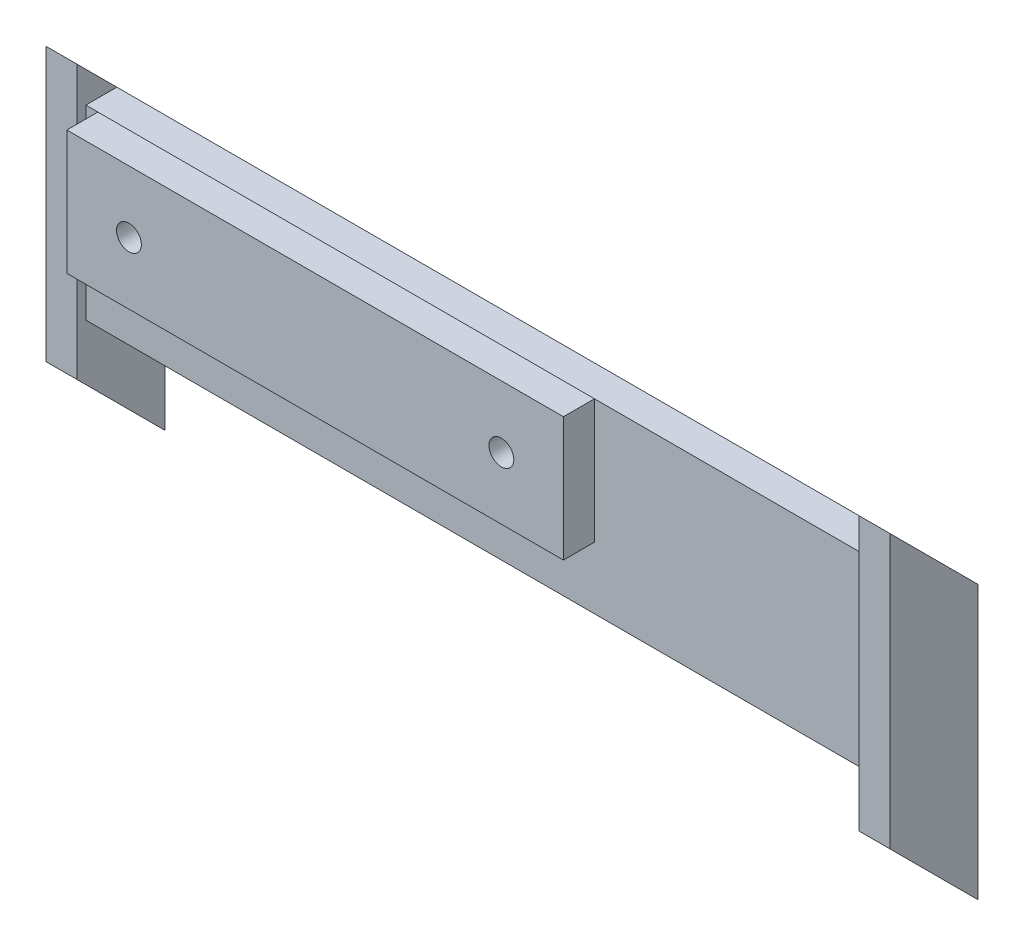
ISO-10303-21;
HEADER;
FILE_DESCRIPTION(('STEP AP214'),'2;1');
FILE_NAME('part.step','',(''),(''),'','','');
FILE_SCHEMA(('AUTOMOTIVE_DESIGN { 1 0 10303 214 1 1 1 1 }'));
ENDSEC;
DATA;
#1=APPLICATION_CONTEXT('core data for automotive mechanical design processes');
#2=APPLICATION_PROTOCOL_DEFINITION('international standard','automotive_design',2000,#1);
#3=PRODUCT_CONTEXT('',#1,'mechanical');
#4=PRODUCT('Part','Part','',(#3));
#5=PRODUCT_RELATED_PRODUCT_CATEGORY('part','',(#4));
#6=PRODUCT_DEFINITION_FORMATION('','',#4);
#7=PRODUCT_DEFINITION_CONTEXT('part definition',#1,'design');
#8=PRODUCT_DEFINITION('design','',#6,#7);
#9=PRODUCT_DEFINITION_SHAPE('','',#8);
#10=(LENGTH_UNIT() NAMED_UNIT(*) SI_UNIT(.MILLI.,.METRE.));
#11=(NAMED_UNIT(*) PLANE_ANGLE_UNIT() SI_UNIT($,.RADIAN.));
#12=(NAMED_UNIT(*) SI_UNIT($,.STERADIAN.) SOLID_ANGLE_UNIT());
#13=UNCERTAINTY_MEASURE_WITH_UNIT(LENGTH_MEASURE(1.E-05),#10,'distance_accuracy_value','');
#14=(GEOMETRIC_REPRESENTATION_CONTEXT(3) GLOBAL_UNCERTAINTY_ASSIGNED_CONTEXT((#13)) GLOBAL_UNIT_ASSIGNED_CONTEXT((#10,
#11,#12)) REPRESENTATION_CONTEXT('',''));
#15=CARTESIAN_POINT('',(0.,0.,0.));
#16=DIRECTION('',(0.,0.,1.));
#17=DIRECTION('',(1.,0.,0.));
#18=AXIS2_PLACEMENT_3D('',#15,#16,#17);
#19=CARTESIAN_POINT('',(0.,0.,-21.2132034355964));
#20=DIRECTION('',(0.,0.,-1.));
#21=DIRECTION('',(0.,1.,0.));
#22=AXIS2_PLACEMENT_3D('',#19,#20,#21);
#23=PLANE('',#22);
#24=DIRECTION('',(0.,1.,0.));
#25=VECTOR('',#24,1.);
#26=CARTESIAN_POINT('',(-63.,0.,-21.2132034355964));
#27=LINE('',#26,#25);
#28=CARTESIAN_POINT('',(-63.,-35.7550361049191,-21.2132034355964));
#29=VERTEX_POINT('',#28);
#30=CARTESIAN_POINT('',(-63.,-5.75503610491914,-21.2132034355964));
#31=VERTEX_POINT('',#30);
#32=EDGE_CURVE('E231',#29,#31,#27,.T.);
#33=ORIENTED_EDGE('',*,*,#32,.F.);
#34=DIRECTION('',(-1.,0.,0.));
#35=VECTOR('',#34,1.);
#36=CARTESIAN_POINT('',(0.,-35.7550361049191,-21.2132034355964));
#37=LINE('',#36,#35);
#38=CARTESIAN_POINT('',(63.,-35.7550361049191,-21.2132034355964));
#39=VERTEX_POINT('',#38);
#40=EDGE_CURVE('E276',#39,#29,#37,.T.);
#41=ORIENTED_EDGE('',*,*,#40,.F.);
#42=DIRECTION('',(0.,-1.,0.));
#43=VECTOR('',#42,1.);
#44=CARTESIAN_POINT('',(63.,0.,-21.2132034355964));
#45=LINE('',#44,#43);
#46=CARTESIAN_POINT('',(63.,-5.75503610491914,-21.2132034355964));
#47=VERTEX_POINT('',#46);
#48=EDGE_CURVE('E269',#47,#39,#45,.T.);
#49=ORIENTED_EDGE('',*,*,#48,.F.);
#50=DIRECTION('',(-1.,0.,0.));
#51=VECTOR('',#50,1.);
#52=CARTESIAN_POINT('',(0.,-5.75503610491914,-21.2132034355964));
#53=LINE('',#52,#51);
#54=CARTESIAN_POINT('',(17.,-5.75503610491914,-21.2132034355964));
#55=VERTEX_POINT('',#54);
#56=EDGE_CURVE('E280',#47,#55,#53,.T.);
#57=ORIENTED_EDGE('',*,*,#56,.T.);
#58=DIRECTION('',(0.,1.,0.));
#59=VECTOR('',#58,1.);
#60=CARTESIAN_POINT('',(17.,-5.75503610491914,-21.2132034355964));
#61=LINE('',#60,#59);
#62=CARTESIAN_POINT('',(17.,-25.7550361049191,-21.2132034355964));
#63=VERTEX_POINT('',#62);
#64=EDGE_CURVE('E317',#63,#55,#61,.T.);
#65=ORIENTED_EDGE('',*,*,#64,.F.);
#66=DIRECTION('',(-1.,0.,0.));
#67=VECTOR('',#66,1.);
#68=CARTESIAN_POINT('',(17.,-25.7550361049191,-21.2132034355964));
#69=LINE('',#68,#67);
#70=CARTESIAN_POINT('',(12.,-25.7550361049191,-21.2132034355964));
#71=VERTEX_POINT('',#70);
#72=EDGE_CURVE('E329',#63,#71,#69,.T.);
#73=ORIENTED_EDGE('',*,*,#72,.T.);
#74=DIRECTION('',(0.,1.,0.));
#75=VECTOR('',#74,1.);
#76=CARTESIAN_POINT('',(12.,-5.75503610491914,-21.2132034355964));
#77=LINE('',#76,#75);
#78=CARTESIAN_POINT('',(12.,-5.75503610491914,-21.2132034355964));
#79=VERTEX_POINT('',#78);
#80=EDGE_CURVE('E309',#71,#79,#77,.T.);
#81=ORIENTED_EDGE('',*,*,#80,.T.);
#82=CARTESIAN_POINT('',(-12.,-5.75503610491912,-21.2132034355964));
#83=VERTEX_POINT('',#82);
#84=EDGE_CURVE('E282',#79,#83,#53,.T.);
#85=ORIENTED_EDGE('',*,*,#84,.T.);
#86=DIRECTION('',(0.,1.,0.));
#87=VECTOR('',#86,1.);
#88=CARTESIAN_POINT('',(-12.,-5.75503610491912,-21.2132034355964));
#89=LINE('',#88,#87);
#90=CARTESIAN_POINT('',(-12.,-25.7550361049191,-21.2132034355964));
#91=VERTEX_POINT('',#90);
#92=EDGE_CURVE('E303',#91,#83,#89,.T.);
#93=ORIENTED_EDGE('',*,*,#92,.F.);
#94=DIRECTION('',(1.,0.,0.));
#95=VECTOR('',#94,1.);
#96=CARTESIAN_POINT('',(-17.,-25.7550361049191,-21.2132034355964));
#97=LINE('',#96,#95);
#98=CARTESIAN_POINT('',(-17.,-25.7550361049191,-21.2132034355964));
#99=VERTEX_POINT('',#98);
#100=EDGE_CURVE('E313',#99,#91,#97,.T.);
#101=ORIENTED_EDGE('',*,*,#100,.F.);
#102=DIRECTION('',(0.,1.,0.));
#103=VECTOR('',#102,1.);
#104=CARTESIAN_POINT('',(-17.,-5.75503610491912,-21.2132034355964));
#105=LINE('',#104,#103);
#106=CARTESIAN_POINT('',(-17.,-5.75503610491914,-21.2132034355964));
#107=VERTEX_POINT('',#106);
#108=EDGE_CURVE('E292',#99,#107,#105,.T.);
#109=ORIENTED_EDGE('',*,*,#108,.T.);
#110=EDGE_CURVE('E271',#107,#31,#53,.T.);
#111=ORIENTED_EDGE('',*,*,#110,.T.);
#112=EDGE_LOOP('',(#33,#41,#49,#57,#65,#73,#81,#85,#93,#101,#109,#111));
#113=FACE_BOUND('',#112,.T.);
#114=ADVANCED_FACE('F37',(#113),#23,.F.);
#115=CARTESIAN_POINT('',(0.,-5.75503610491914,-26.2132034355964));
#116=DIRECTION('',(0.,1.,0.));
#117=DIRECTION('',(0.,0.,1.));
#118=AXIS2_PLACEMENT_3D('',#115,#116,#117);
#119=PLANE('',#118);
#120=DIRECTION('',(-1.,0.,0.));
#121=VECTOR('',#120,1.);
#122=CARTESIAN_POINT('',(0.,-5.75503610491914,-26.2132034355964));
#123=LINE('',#122,#121);
#124=CARTESIAN_POINT('',(63.,-5.75503610491914,-26.2132034355964));
#125=VERTEX_POINT('',#124);
#126=CARTESIAN_POINT('',(-63.,-5.75503610491914,-26.2132034355964));
#127=VERTEX_POINT('',#126);
#128=EDGE_CURVE('E272',#125,#127,#123,.T.);
#129=ORIENTED_EDGE('',*,*,#128,.T.);
#130=DIRECTION('',(0.,0.,1.));
#131=VECTOR('',#130,1.);
#132=CARTESIAN_POINT('',(-63.,-5.75503610491914,-26.2132034355964));
#133=LINE('',#132,#131);
#134=EDGE_CURVE('E223',#127,#31,#133,.T.);
#135=ORIENTED_EDGE('',*,*,#134,.T.);
#136=ORIENTED_EDGE('',*,*,#110,.F.);
#137=DIRECTION('',(1.,0.,0.));
#138=VECTOR('',#137,1.);
#139=CARTESIAN_POINT('',(-17.,-5.75503610491912,-21.2132034355964));
#140=LINE('',#139,#138);
#141=EDGE_CURVE('E310',#107,#83,#140,.T.);
#142=ORIENTED_EDGE('',*,*,#141,.T.);
#143=ORIENTED_EDGE('',*,*,#84,.F.);
#144=DIRECTION('',(-1.,0.,0.));
#145=VECTOR('',#144,1.);
#146=CARTESIAN_POINT('',(17.,-5.75503610491914,-21.2132034355964));
#147=LINE('',#146,#145);
#148=EDGE_CURVE('E348',#55,#79,#147,.T.);
#149=ORIENTED_EDGE('',*,*,#148,.F.);
#150=ORIENTED_EDGE('',*,*,#56,.F.);
#151=DIRECTION('',(0.,0.,-1.));
#152=VECTOR('',#151,1.);
#153=CARTESIAN_POINT('',(63.,-5.75503610491914,-26.2132034355964));
#154=LINE('',#153,#152);
#155=EDGE_CURVE('E266',#47,#125,#154,.T.);
#156=ORIENTED_EDGE('',*,*,#155,.T.);
#157=EDGE_LOOP('',(#129,#135,#136,#142,#143,#149,#150,#156));
#158=FACE_BOUND('',#157,.T.);
#159=ADVANCED_FACE('F422',(#158),#119,.T.);
#160=CARTESIAN_POINT('',(0.,-35.7550361049191,-26.2132034355964));
#161=DIRECTION('',(0.,1.,0.));
#162=DIRECTION('',(0.,0.,1.));
#163=AXIS2_PLACEMENT_3D('',#160,#161,#162);
#164=PLANE('',#163);
#165=DIRECTION('',(0.,0.,1.));
#166=VECTOR('',#165,1.);
#167=CARTESIAN_POINT('',(-63.,-35.7550361049191,-26.2132034355964));
#168=LINE('',#167,#166);
#169=CARTESIAN_POINT('',(-63.,-35.7550361049191,-26.2132034355964));
#170=VERTEX_POINT('',#169);
#171=EDGE_CURVE('E221',#170,#29,#168,.T.);
#172=ORIENTED_EDGE('',*,*,#171,.F.);
#173=DIRECTION('',(-1.,0.,0.));
#174=VECTOR('',#173,1.);
#175=CARTESIAN_POINT('',(0.,-35.7550361049191,-26.2132034355964));
#176=LINE('',#175,#174);
#177=CARTESIAN_POINT('',(63.,-35.7550361049191,-26.2132034355964));
#178=VERTEX_POINT('',#177);
#179=EDGE_CURVE('E275',#178,#170,#176,.T.);
#180=ORIENTED_EDGE('',*,*,#179,.F.);
#181=DIRECTION('',(0.,0.,-1.));
#182=VECTOR('',#181,1.);
#183=CARTESIAN_POINT('',(63.,-35.7550361049191,-26.2132034355964));
#184=LINE('',#183,#182);
#185=EDGE_CURVE('E60',#39,#178,#184,.T.);
#186=ORIENTED_EDGE('',*,*,#185,.F.);
#187=ORIENTED_EDGE('',*,*,#40,.T.);
#188=EDGE_LOOP('',(#172,#180,#186,#187));
#189=FACE_BOUND('',#188,.T.);
#190=ADVANCED_FACE('F406',(#189),#164,.F.);
#191=CARTESIAN_POINT('',(0.,0.,-26.2132034355964));
#192=DIRECTION('',(0.,0.,-1.));
#193=DIRECTION('',(0.,1.,0.));
#194=AXIS2_PLACEMENT_3D('',#191,#192,#193);
#195=PLANE('',#194);
#196=ORIENTED_EDGE('',*,*,#179,.T.);
#197=DIRECTION('',(0.,1.,0.));
#198=VECTOR('',#197,1.);
#199=CARTESIAN_POINT('',(-63.,0.,-26.2132034355964));
#200=LINE('',#199,#198);
#201=EDGE_CURVE('E11',#170,#127,#200,.T.);
#202=ORIENTED_EDGE('',*,*,#201,.T.);
#203=ORIENTED_EDGE('',*,*,#128,.F.);
#204=DIRECTION('',(0.,-1.,0.));
#205=VECTOR('',#204,1.);
#206=CARTESIAN_POINT('',(63.,0.,-26.2132034355964));
#207=LINE('',#206,#205);
#208=EDGE_CURVE('E45',#125,#178,#207,.T.);
#209=ORIENTED_EDGE('',*,*,#208,.T.);
#210=EDGE_LOOP('',(#196,#202,#203,#209));
#211=FACE_BOUND('',#210,.T.);
#212=ADVANCED_FACE('F401',(#211),#195,.T.);
#213=CARTESIAN_POINT('',(0.,0.,0.));
#214=DIRECTION('',(0.,0.,-1.));
#215=DIRECTION('',(-1.,0.,0.));
#216=AXIS2_PLACEMENT_3D('',#213,#214,#215);
#217=PLANE('',#216);
#218=DIRECTION('',(1.,0.,0.));
#219=VECTOR('',#218,1.);
#220=CARTESIAN_POINT('',(40.1593625498008,-4.54183266932271,0.));
#221=LINE('',#220,#219);
#222=CARTESIAN_POINT('',(-12.,-4.54183266932271,0.));
#223=VERTEX_POINT('',#222);
#224=CARTESIAN_POINT('',(12.,-4.54183266932272,0.));
#225=VERTEX_POINT('',#224);
#226=EDGE_CURVE('E382',#223,#225,#221,.T.);
#227=ORIENTED_EDGE('',*,*,#226,.F.);
#228=DIRECTION('',(0.,-1.,0.));
#229=VECTOR('',#228,1.);
#230=CARTESIAN_POINT('',(-12.,15.4581673306773,0.));
#231=LINE('',#230,#229);
#232=CARTESIAN_POINT('',(-12.,15.4581673306773,0.));
#233=VERTEX_POINT('',#232);
#234=EDGE_CURVE('E279',#233,#223,#231,.T.);
#235=ORIENTED_EDGE('',*,*,#234,.F.);
#236=DIRECTION('',(-1.,0.,0.));
#237=VECTOR('',#236,1.);
#238=CARTESIAN_POINT('',(-39.8406374501992,15.4581673306773,0.));
#239=LINE('',#238,#237);
#240=CARTESIAN_POINT('',(12.,15.4581673306773,0.));
#241=VERTEX_POINT('',#240);
#242=EDGE_CURVE('E387',#241,#233,#239,.T.);
#243=ORIENTED_EDGE('',*,*,#242,.F.);
#244=DIRECTION('',(0.,-1.,0.));
#245=VECTOR('',#244,1.);
#246=CARTESIAN_POINT('',(12.,15.4581673306773,0.));
#247=LINE('',#246,#245);
#248=EDGE_CURVE('E335',#241,#225,#247,.T.);
#249=ORIENTED_EDGE('',*,*,#248,.T.);
#250=EDGE_LOOP('',(#227,#235,#243,#249));
#251=FACE_BOUND('',#250,.T.);
#252=ADVANCED_FACE('F436',(#251),#217,.T.);
#253=DIRECTION('',(0.,-1.,0.));
#254=VECTOR('',#253,1.);
#255=CARTESIAN_POINT('',(-17.,15.4581673306773,0.));
#256=LINE('',#255,#254);
#257=CARTESIAN_POINT('',(-17.,15.4581673306773,0.));
#258=VERTEX_POINT('',#257);
#259=CARTESIAN_POINT('',(-17.,-4.54183266932271,0.));
#260=VERTEX_POINT('',#259);
#261=EDGE_CURVE('E285',#258,#260,#256,.T.);
#262=ORIENTED_EDGE('',*,*,#261,.T.);
#263=CARTESIAN_POINT('',(-39.8406374501992,-4.54183266932272,0.));
#264=VERTEX_POINT('',#263);
#265=EDGE_CURVE('E378',#264,#260,#221,.T.);
#266=ORIENTED_EDGE('',*,*,#265,.F.);
#267=DIRECTION('',(0.,-1.,0.));
#268=VECTOR('',#267,1.);
#269=CARTESIAN_POINT('',(-39.8406374501992,15.4581673306773,0.));
#270=LINE('',#269,#268);
#271=CARTESIAN_POINT('',(-39.8406374501992,15.4581673306773,0.));
#272=VERTEX_POINT('',#271);
#273=EDGE_CURVE('E361',#272,#264,#270,.T.);
#274=ORIENTED_EDGE('',*,*,#273,.F.);
#275=EDGE_CURVE('E384',#258,#272,#239,.T.);
#276=ORIENTED_EDGE('',*,*,#275,.F.);
#277=EDGE_LOOP('',(#262,#266,#274,#276));
#278=FACE_BOUND('',#277,.T.);
#279=CARTESIAN_POINT('',(-29.8406374501992,5.45816733067729,0.));
#280=DIRECTION('',(0.,0.,1.));
#281=DIRECTION('',(1.,0.,0.));
#282=AXIS2_PLACEMENT_3D('',#279,#280,#281);
#283=CIRCLE('',#282,2.);
#284=CARTESIAN_POINT('',(-27.8406374501992,5.45816733067729,0.));
#285=VERTEX_POINT('',#284);
#286=EDGE_CURVE('E355',#285,#285,#283,.T.);
#287=ORIENTED_EDGE('',*,*,#286,.T.);
#288=EDGE_LOOP('',(#287));
#289=FACE_BOUND('',#288,.T.);
#290=ADVANCED_FACE('F448',(#278,#289),#217,.T.);
#291=CARTESIAN_POINT('',(0.,0.,5.));
#292=DIRECTION('',(0.,0.,-1.));
#293=DIRECTION('',(-1.,0.,0.));
#294=AXIS2_PLACEMENT_3D('',#291,#292,#293);
#295=PLANE('',#294);
#296=DIRECTION('',(0.,-1.,0.));
#297=VECTOR('',#296,1.);
#298=CARTESIAN_POINT('',(-39.8406374501992,15.4581673306773,5.));
#299=LINE('',#298,#297);
#300=CARTESIAN_POINT('',(-39.8406374501992,15.4581673306773,5.));
#301=VERTEX_POINT('',#300);
#302=CARTESIAN_POINT('',(-39.8406374501992,-4.54183266932272,5.));
#303=VERTEX_POINT('',#302);
#304=EDGE_CURVE('E364',#301,#303,#299,.T.);
#305=ORIENTED_EDGE('',*,*,#304,.T.);
#306=DIRECTION('',(1.,0.,0.));
#307=VECTOR('',#306,1.);
#308=CARTESIAN_POINT('',(40.1593625498008,-4.54183266932271,5.));
#309=LINE('',#308,#307);
#310=CARTESIAN_POINT('',(40.1593625498008,-4.54183266932271,5.));
#311=VERTEX_POINT('',#310);
#312=EDGE_CURVE('E367',#303,#311,#309,.T.);
#313=ORIENTED_EDGE('',*,*,#312,.T.);
#314=DIRECTION('',(0.,1.,0.));
#315=VECTOR('',#314,1.);
#316=CARTESIAN_POINT('',(40.1593625498008,15.4581673306773,5.));
#317=LINE('',#316,#315);
#318=CARTESIAN_POINT('',(40.1593625498008,15.4581673306773,5.));
#319=VERTEX_POINT('',#318);
#320=EDGE_CURVE('E370',#311,#319,#317,.T.);
#321=ORIENTED_EDGE('',*,*,#320,.T.);
#322=DIRECTION('',(-1.,0.,0.));
#323=VECTOR('',#322,1.);
#324=CARTESIAN_POINT('',(-39.8406374501992,15.4581673306773,5.));
#325=LINE('',#324,#323);
#326=EDGE_CURVE('E372',#319,#301,#325,.T.);
#327=ORIENTED_EDGE('',*,*,#326,.T.);
#328=EDGE_LOOP('',(#305,#313,#321,#327));
#329=FACE_BOUND('',#328,.T.);
#330=CARTESIAN_POINT('',(-29.8406374501992,5.45816733067729,5.));
#331=DIRECTION('',(0.,0.,1.));
#332=DIRECTION('',(1.,0.,0.));
#333=AXIS2_PLACEMENT_3D('',#330,#331,#332);
#334=CIRCLE('',#333,2.);
#335=CARTESIAN_POINT('',(-27.8406374501992,5.45816733067729,5.));
#336=VERTEX_POINT('',#335);
#337=EDGE_CURVE('E358',#336,#336,#334,.T.);
#338=ORIENTED_EDGE('',*,*,#337,.F.);
#339=EDGE_LOOP('',(#338));
#340=FACE_BOUND('',#339,.T.);
#341=CARTESIAN_POINT('',(30.1593625498008,5.45816733067729,5.));
#342=DIRECTION('',(0.,0.,1.));
#343=DIRECTION('',(1.,0.,0.));
#344=AXIS2_PLACEMENT_3D('',#341,#342,#343);
#345=CIRCLE('',#344,2.);
#346=CARTESIAN_POINT('',(32.1593625498008,5.45816733067729,5.));
#347=VERTEX_POINT('',#346);
#348=EDGE_CURVE('E352',#347,#347,#345,.T.);
#349=ORIENTED_EDGE('',*,*,#348,.F.);
#350=EDGE_LOOP('',(#349));
#351=FACE_BOUND('',#350,.T.);
#352=ADVANCED_FACE('F455',(#329,#340,#351),#295,.F.);
#353=DIRECTION('',(0.,-1.,0.));
#354=VECTOR('',#353,1.);
#355=CARTESIAN_POINT('',(17.,15.4581673306773,0.));
#356=LINE('',#355,#354);
#357=CARTESIAN_POINT('',(17.,15.4581673306773,0.));
#358=VERTEX_POINT('',#357);
#359=CARTESIAN_POINT('',(17.,-4.54183266932271,0.));
#360=VERTEX_POINT('',#359);
#361=EDGE_CURVE('E324',#358,#360,#356,.T.);
#362=ORIENTED_EDGE('',*,*,#361,.F.);
#363=CARTESIAN_POINT('',(40.1593625498008,15.4581673306773,0.));
#364=VERTEX_POINT('',#363);
#365=EDGE_CURVE('E368',#364,#358,#239,.T.);
#366=ORIENTED_EDGE('',*,*,#365,.F.);
#367=DIRECTION('',(0.,1.,0.));
#368=VECTOR('',#367,1.);
#369=CARTESIAN_POINT('',(40.1593625498008,15.4581673306773,0.));
#370=LINE('',#369,#368);
#371=CARTESIAN_POINT('',(40.1593625498008,-4.54183266932271,0.));
#372=VERTEX_POINT('',#371);
#373=EDGE_CURVE('E381',#372,#364,#370,.T.);
#374=ORIENTED_EDGE('',*,*,#373,.F.);
#375=EDGE_CURVE('E377',#360,#372,#221,.T.);
#376=ORIENTED_EDGE('',*,*,#375,.F.);
#377=EDGE_LOOP('',(#362,#366,#374,#376));
#378=FACE_BOUND('',#377,.T.);
#379=CARTESIAN_POINT('',(30.1593625498008,5.45816733067729,0.));
#380=DIRECTION('',(0.,0.,1.));
#381=DIRECTION('',(1.,0.,0.));
#382=AXIS2_PLACEMENT_3D('',#379,#380,#381);
#383=CIRCLE('',#382,2.);
#384=CARTESIAN_POINT('',(32.1593625498008,5.45816733067729,0.));
#385=VERTEX_POINT('',#384);
#386=EDGE_CURVE('E351',#385,#385,#383,.T.);
#387=ORIENTED_EDGE('',*,*,#386,.T.);
#388=EDGE_LOOP('',(#387));
#389=FACE_BOUND('',#388,.T.);
#390=ADVANCED_FACE('F462',(#378,#389),#217,.T.);
#391=CARTESIAN_POINT('',(-39.8406374501992,15.4581673306773,5.));
#392=DIRECTION('',(1.,0.,0.));
#393=DIRECTION('',(0.,1.,0.));
#394=AXIS2_PLACEMENT_3D('',#391,#392,#393);
#395=PLANE('',#394);
#396=ORIENTED_EDGE('',*,*,#273,.T.);
#397=DIRECTION('',(0.,0.,-1.));
#398=VECTOR('',#397,1.);
#399=CARTESIAN_POINT('',(-39.8406374501992,-4.54183266932272,5.));
#400=LINE('',#399,#398);
#401=EDGE_CURVE('E396',#303,#264,#400,.T.);
#402=ORIENTED_EDGE('',*,*,#401,.F.);
#403=ORIENTED_EDGE('',*,*,#304,.F.);
#404=DIRECTION('',(0.,0.,-1.));
#405=VECTOR('',#404,1.);
#406=CARTESIAN_POINT('',(-39.8406374501992,15.4581673306773,5.));
#407=LINE('',#406,#405);
#408=EDGE_CURVE('E374',#301,#272,#407,.T.);
#409=ORIENTED_EDGE('',*,*,#408,.T.);
#410=EDGE_LOOP('',(#396,#402,#403,#409));
#411=FACE_BOUND('',#410,.T.);
#412=ADVANCED_FACE('F39',(#411),#395,.F.);
#413=CARTESIAN_POINT('',(40.1593625498008,-4.54183266932271,5.));
#414=DIRECTION('',(0.,1.,0.));
#415=DIRECTION('',(-1.,0.,0.));
#416=AXIS2_PLACEMENT_3D('',#413,#414,#415);
#417=PLANE('',#416);
#418=ORIENTED_EDGE('',*,*,#265,.T.);
#419=DIRECTION('',(1.,0.,0.));
#420=VECTOR('',#419,1.);
#421=CARTESIAN_POINT('',(-17.,-4.54183266932271,0.));
#422=LINE('',#421,#420);
#423=EDGE_CURVE('E297',#260,#223,#422,.T.);
#424=ORIENTED_EDGE('',*,*,#423,.T.);
#425=ORIENTED_EDGE('',*,*,#226,.T.);
#426=DIRECTION('',(-1.,0.,0.));
#427=VECTOR('',#426,1.);
#428=CARTESIAN_POINT('',(17.,-4.54183266932271,0.));
#429=LINE('',#428,#427);
#430=EDGE_CURVE('E342',#360,#225,#429,.T.);
#431=ORIENTED_EDGE('',*,*,#430,.F.);
#432=ORIENTED_EDGE('',*,*,#375,.T.);
#433=DIRECTION('',(0.,0.,-1.));
#434=VECTOR('',#433,1.);
#435=CARTESIAN_POINT('',(40.1593625498008,-4.54183266932271,5.));
#436=LINE('',#435,#434);
#437=EDGE_CURVE('E393',#311,#372,#436,.T.);
#438=ORIENTED_EDGE('',*,*,#437,.F.);
#439=ORIENTED_EDGE('',*,*,#312,.F.);
#440=ORIENTED_EDGE('',*,*,#401,.T.);
#441=EDGE_LOOP('',(#418,#424,#425,#431,#432,#438,#439,#440));
#442=FACE_BOUND('',#441,.T.);
#443=ADVANCED_FACE('F451',(#442),#417,.F.);
#444=CARTESIAN_POINT('',(40.1593625498008,15.4581673306773,5.));
#445=DIRECTION('',(-1.,0.,0.));
#446=DIRECTION('',(0.,0.,1.));
#447=AXIS2_PLACEMENT_3D('',#444,#445,#446);
#448=PLANE('',#447);
#449=ORIENTED_EDGE('',*,*,#373,.T.);
#450=DIRECTION('',(0.,0.,-1.));
#451=VECTOR('',#450,1.);
#452=CARTESIAN_POINT('',(40.1593625498008,15.4581673306773,5.));
#453=LINE('',#452,#451);
#454=EDGE_CURVE('E390',#319,#364,#453,.T.);
#455=ORIENTED_EDGE('',*,*,#454,.F.);
#456=ORIENTED_EDGE('',*,*,#320,.F.);
#457=ORIENTED_EDGE('',*,*,#437,.T.);
#458=EDGE_LOOP('',(#449,#455,#456,#457));
#459=FACE_BOUND('',#458,.T.);
#460=ADVANCED_FACE('F512',(#459),#448,.F.);
#461=CARTESIAN_POINT('',(-39.8406374501992,15.4581673306773,5.));
#462=DIRECTION('',(0.,-1.,0.));
#463=DIRECTION('',(0.,0.,-1.));
#464=AXIS2_PLACEMENT_3D('',#461,#462,#463);
#465=PLANE('',#464);
#466=ORIENTED_EDGE('',*,*,#365,.T.);
#467=DIRECTION('',(-1.,0.,0.));
#468=VECTOR('',#467,1.);
#469=CARTESIAN_POINT('',(17.,15.4581673306773,0.));
#470=LINE('',#469,#468);
#471=EDGE_CURVE('E345',#358,#241,#470,.T.);
#472=ORIENTED_EDGE('',*,*,#471,.T.);
#473=ORIENTED_EDGE('',*,*,#242,.T.);
#474=DIRECTION('',(1.,0.,0.));
#475=VECTOR('',#474,1.);
#476=CARTESIAN_POINT('',(-17.,15.4581673306773,0.));
#477=LINE('',#476,#475);
#478=EDGE_CURVE('E307',#258,#233,#477,.T.);
#479=ORIENTED_EDGE('',*,*,#478,.F.);
#480=ORIENTED_EDGE('',*,*,#275,.T.);
#481=ORIENTED_EDGE('',*,*,#408,.F.);
#482=ORIENTED_EDGE('',*,*,#326,.F.);
#483=ORIENTED_EDGE('',*,*,#454,.T.);
#484=EDGE_LOOP('',(#466,#472,#473,#479,#480,#481,#482,#483));
#485=FACE_BOUND('',#484,.T.);
#486=ADVANCED_FACE('F438',(#485),#465,.F.);
#487=CARTESIAN_POINT('',(-29.8406374501992,5.45816733067729,5.));
#488=DIRECTION('',(0.,0.,-1.));
#489=DIRECTION('',(-1.,0.,0.));
#490=AXIS2_PLACEMENT_3D('',#487,#488,#489);
#491=CYLINDRICAL_SURFACE('',#490,2.);
#492=ORIENTED_EDGE('',*,*,#337,.T.);
#493=EDGE_LOOP('',(#492));
#494=FACE_BOUND('',#493,.T.);
#495=ORIENTED_EDGE('',*,*,#286,.F.);
#496=EDGE_LOOP('',(#495));
#497=FACE_BOUND('',#496,.T.);
#498=ADVANCED_FACE('F519',(#494,#497),#491,.F.);
#499=CARTESIAN_POINT('',(30.1593625498008,5.45816733067729,5.));
#500=DIRECTION('',(0.,0.,-1.));
#501=DIRECTION('',(-1.,0.,0.));
#502=AXIS2_PLACEMENT_3D('',#499,#500,#501);
#503=CYLINDRICAL_SURFACE('',#502,2.);
#504=ORIENTED_EDGE('',*,*,#348,.T.);
#505=EDGE_LOOP('',(#504));
#506=FACE_BOUND('',#505,.T.);
#507=ORIENTED_EDGE('',*,*,#386,.F.);
#508=EDGE_LOOP('',(#507));
#509=FACE_BOUND('',#508,.T.);
#510=ADVANCED_FACE('F528',(#506,#509),#503,.F.);
#511=CARTESIAN_POINT('',(17.,15.4581673306773,0.));
#512=DIRECTION('',(0.,-0.707106781186548,0.707106781186548));
#513=DIRECTION('',(0.,-0.707106781186548,-0.707106781186548));
#514=AXIS2_PLACEMENT_3D('',#511,#512,#513);
#515=PLANE('',#514);
#516=DIRECTION('',(0.,0.707106781186547,0.707106781186547));
#517=VECTOR('',#516,1.);
#518=CARTESIAN_POINT('',(12.,15.4581673306773,0.));
#519=LINE('',#518,#517);
#520=EDGE_CURVE('E332',#79,#241,#519,.T.);
#521=ORIENTED_EDGE('',*,*,#520,.T.);
#522=ORIENTED_EDGE('',*,*,#471,.F.);
#523=DIRECTION('',(0.,0.707106781186547,0.707106781186547));
#524=VECTOR('',#523,1.);
#525=CARTESIAN_POINT('',(17.,15.4581673306773,0.));
#526=LINE('',#525,#524);
#527=EDGE_CURVE('E320',#55,#358,#526,.T.);
#528=ORIENTED_EDGE('',*,*,#527,.F.);
#529=ORIENTED_EDGE('',*,*,#148,.T.);
#530=EDGE_LOOP('',(#521,#522,#528,#529));
#531=FACE_BOUND('',#530,.T.);
#532=ADVANCED_FACE('F475',(#531),#515,.F.);
#533=CARTESIAN_POINT('',(17.,-4.54183266932271,0.));
#534=DIRECTION('',(0.,0.707106781186547,-0.707106781186548));
#535=DIRECTION('',(0.,0.707106781186548,0.707106781186547));
#536=AXIS2_PLACEMENT_3D('',#533,#534,#535);
#537=PLANE('',#536);
#538=DIRECTION('',(0.,-0.707106781186548,-0.707106781186547));
#539=VECTOR('',#538,1.);
#540=CARTESIAN_POINT('',(12.,-4.54183266932271,0.));
#541=LINE('',#540,#539);
#542=EDGE_CURVE('E321',#225,#71,#541,.T.);
#543=ORIENTED_EDGE('',*,*,#542,.T.);
#544=ORIENTED_EDGE('',*,*,#72,.F.);
#545=DIRECTION('',(0.,-0.707106781186548,-0.707106781186547));
#546=VECTOR('',#545,1.);
#547=CARTESIAN_POINT('',(17.,-4.54183266932271,0.));
#548=LINE('',#547,#546);
#549=EDGE_CURVE('E327',#360,#63,#548,.T.);
#550=ORIENTED_EDGE('',*,*,#549,.F.);
#551=ORIENTED_EDGE('',*,*,#430,.T.);
#552=EDGE_LOOP('',(#543,#544,#550,#551));
#553=FACE_BOUND('',#552,.T.);
#554=ADVANCED_FACE('F471',(#553),#537,.F.);
#555=CARTESIAN_POINT('',(17.,0.,0.));
#556=DIRECTION('',(1.,0.,0.));
#557=DIRECTION('',(0.,0.,-1.));
#558=AXIS2_PLACEMENT_3D('',#555,#556,#557);
#559=PLANE('',#558);
#560=ORIENTED_EDGE('',*,*,#64,.T.);
#561=ORIENTED_EDGE('',*,*,#527,.T.);
#562=ORIENTED_EDGE('',*,*,#361,.T.);
#563=ORIENTED_EDGE('',*,*,#549,.T.);
#564=EDGE_LOOP('',(#560,#561,#562,#563));
#565=FACE_BOUND('',#564,.T.);
#566=ADVANCED_FACE('F467',(#565),#559,.T.);
#567=CARTESIAN_POINT('',(12.,0.,0.));
#568=DIRECTION('',(1.,0.,0.));
#569=DIRECTION('',(0.,0.,-1.));
#570=AXIS2_PLACEMENT_3D('',#567,#568,#569);
#571=PLANE('',#570);
#572=ORIENTED_EDGE('',*,*,#80,.F.);
#573=ORIENTED_EDGE('',*,*,#542,.F.);
#574=ORIENTED_EDGE('',*,*,#248,.F.);
#575=ORIENTED_EDGE('',*,*,#520,.F.);
#576=EDGE_LOOP('',(#572,#573,#574,#575));
#577=FACE_BOUND('',#576,.T.);
#578=ADVANCED_FACE('F478',(#577),#571,.F.);
#579=CARTESIAN_POINT('',(-17.,15.4581673306773,0.));
#580=DIRECTION('',(0.,0.707106781186548,-0.707106781186547));
#581=DIRECTION('',(0.,0.707106781186547,0.707106781186548));
#582=AXIS2_PLACEMENT_3D('',#579,#580,#581);
#583=PLANE('',#582);
#584=DIRECTION('',(0.,0.707106781186547,0.707106781186548));
#585=VECTOR('',#584,1.);
#586=CARTESIAN_POINT('',(-12.,15.4581673306773,0.));
#587=LINE('',#586,#585);
#588=EDGE_CURVE('E289',#83,#233,#587,.T.);
#589=ORIENTED_EDGE('',*,*,#588,.F.);
#590=ORIENTED_EDGE('',*,*,#141,.F.);
#591=DIRECTION('',(0.,0.707106781186547,0.707106781186548));
#592=VECTOR('',#591,1.);
#593=CARTESIAN_POINT('',(-17.,15.4581673306773,0.));
#594=LINE('',#593,#592);
#595=EDGE_CURVE('E295',#107,#258,#594,.T.);
#596=ORIENTED_EDGE('',*,*,#595,.T.);
#597=ORIENTED_EDGE('',*,*,#478,.T.);
#598=EDGE_LOOP('',(#589,#590,#596,#597));
#599=FACE_BOUND('',#598,.T.);
#600=ADVANCED_FACE('F427',(#599),#583,.T.);
#601=CARTESIAN_POINT('',(-17.,-25.7550361049191,-21.2132034355964));
#602=DIRECTION('',(0.,-0.707106781186547,0.707106781186548));
#603=DIRECTION('',(0.,-0.707106781186548,-0.707106781186547));
#604=AXIS2_PLACEMENT_3D('',#601,#602,#603);
#605=PLANE('',#604);
#606=DIRECTION('',(0.,-0.707106781186548,-0.707106781186547));
#607=VECTOR('',#606,1.);
#608=CARTESIAN_POINT('',(-12.,-25.7550361049191,-21.2132034355964));
#609=LINE('',#608,#607);
#610=EDGE_CURVE('E300',#223,#91,#609,.T.);
#611=ORIENTED_EDGE('',*,*,#610,.F.);
#612=ORIENTED_EDGE('',*,*,#423,.F.);
#613=DIRECTION('',(0.,-0.707106781186548,-0.707106781186547));
#614=VECTOR('',#613,1.);
#615=CARTESIAN_POINT('',(-17.,-25.7550361049191,-21.2132034355964));
#616=LINE('',#615,#614);
#617=EDGE_CURVE('E288',#260,#99,#616,.T.);
#618=ORIENTED_EDGE('',*,*,#617,.T.);
#619=ORIENTED_EDGE('',*,*,#100,.T.);
#620=EDGE_LOOP('',(#611,#612,#618,#619));
#621=FACE_BOUND('',#620,.T.);
#622=ADVANCED_FACE('F485',(#621),#605,.T.);
#623=CARTESIAN_POINT('',(-17.,0.,0.));
#624=DIRECTION('',(-1.,0.,0.));
#625=DIRECTION('',(0.,0.,1.));
#626=AXIS2_PLACEMENT_3D('',#623,#624,#625);
#627=PLANE('',#626);
#628=ORIENTED_EDGE('',*,*,#261,.F.);
#629=ORIENTED_EDGE('',*,*,#595,.F.);
#630=ORIENTED_EDGE('',*,*,#108,.F.);
#631=ORIENTED_EDGE('',*,*,#617,.F.);
#632=EDGE_LOOP('',(#628,#629,#630,#631));
#633=FACE_BOUND('',#632,.T.);
#634=ADVANCED_FACE('F500',(#633),#627,.T.);
#635=CARTESIAN_POINT('',(-12.,0.,0.));
#636=DIRECTION('',(-1.,0.,0.));
#637=DIRECTION('',(0.,0.,1.));
#638=AXIS2_PLACEMENT_3D('',#635,#636,#637);
#639=PLANE('',#638);
#640=ORIENTED_EDGE('',*,*,#234,.T.);
#641=ORIENTED_EDGE('',*,*,#610,.T.);
#642=ORIENTED_EDGE('',*,*,#92,.T.);
#643=ORIENTED_EDGE('',*,*,#588,.T.);
#644=EDGE_LOOP('',(#640,#641,#642,#643));
#645=FACE_BOUND('',#644,.T.);
#646=ADVANCED_FACE('F432',(#645),#639,.F.);
#647=CARTESIAN_POINT('',(63.,0.,0.));
#648=DIRECTION('',(1.,0.,0.));
#649=DIRECTION('',(0.,0.,-1.));
#650=AXIS2_PLACEMENT_3D('',#647,#648,#649);
#651=PLANE('',#650);
#652=ORIENTED_EDGE('',*,*,#155,.F.);
#653=ORIENTED_EDGE('',*,*,#48,.T.);
#654=ORIENTED_EDGE('',*,*,#185,.T.);
#655=ORIENTED_EDGE('',*,*,#208,.F.);
#656=DIRECTION('',(0.,0.707106781186547,0.707106781186548));
#657=VECTOR('',#656,1.);
#658=CARTESIAN_POINT('',(63.,-5.75503610491914,-26.2132034355964));
#659=LINE('',#658,#657);
#660=CARTESIAN_POINT('',(63.,-13.482958166277,-33.9411254969543));
#661=VERTEX_POINT('',#660);
#662=EDGE_CURVE('E237',#661,#125,#659,.T.);
#663=ORIENTED_EDGE('',*,*,#662,.F.);
#664=DIRECTION('',(0.,1.,0.));
#665=VECTOR('',#664,1.);
#666=CARTESIAN_POINT('',(63.,-50.5540259781422,-33.9411254969543));
#667=LINE('',#666,#665);
#668=CARTESIAN_POINT('',(63.,-57.482958166277,-33.9411254969543));
#669=VERTEX_POINT('',#668);
#670=EDGE_CURVE('E249',#669,#661,#667,.T.);
#671=ORIENTED_EDGE('',*,*,#670,.F.);
#672=DIRECTION('',(0.,-0.707106781186547,-0.707106781186548));
#673=VECTOR('',#672,1.);
#674=CARTESIAN_POINT('',(63.,-44.7550361049191,-21.2132034355964));
#675=LINE('',#674,#673);
#676=CARTESIAN_POINT('',(63.,-43.340822542546,-19.7989898732233));
#677=VERTEX_POINT('',#676);
#678=EDGE_CURVE('E246',#677,#669,#675,.T.);
#679=ORIENTED_EDGE('',*,*,#678,.F.);
#680=DIRECTION('',(0.,-1.,0.));
#681=VECTOR('',#680,1.);
#682=CARTESIAN_POINT('',(63.,0.65917745745395,-19.7989898732233));
#683=LINE('',#682,#681);
#684=CARTESIAN_POINT('',(63.,0.65917745745395,-19.7989898732233));
#685=VERTEX_POINT('',#684);
#686=EDGE_CURVE('E233',#685,#677,#683,.T.);
#687=ORIENTED_EDGE('',*,*,#686,.F.);
#688=EDGE_CURVE('E251',#125,#685,#659,.T.);
#689=ORIENTED_EDGE('',*,*,#688,.F.);
#690=EDGE_LOOP('',(#652,#653,#654,#655,#663,#671,#679,#687,#689));
#691=FACE_BOUND('',#690,.T.);
#692=ADVANCED_FACE('F505',(#691),#651,.F.);
#693=CARTESIAN_POINT('',(68.,0.65917745745395,-19.7989898732233));
#694=DIRECTION('',(0.,0.,-1.));
#695=DIRECTION('',(0.,1.,0.));
#696=AXIS2_PLACEMENT_3D('',#693,#694,#695);
#697=PLANE('',#696);
#698=ORIENTED_EDGE('',*,*,#686,.T.);
#699=DIRECTION('',(-1.,0.,0.));
#700=VECTOR('',#699,1.);
#701=CARTESIAN_POINT('',(68.,-43.340822542546,-19.7989898732233));
#702=LINE('',#701,#700);
#703=CARTESIAN_POINT('',(68.,-43.340822542546,-19.7989898732233));
#704=VERTEX_POINT('',#703);
#705=EDGE_CURVE('E259',#704,#677,#702,.T.);
#706=ORIENTED_EDGE('',*,*,#705,.F.);
#707=DIRECTION('',(0.,-1.,0.));
#708=VECTOR('',#707,1.);
#709=CARTESIAN_POINT('',(68.,0.65917745745395,-19.7989898732233));
#710=LINE('',#709,#708);
#711=CARTESIAN_POINT('',(68.,0.65917745745395,-19.7989898732233));
#712=VERTEX_POINT('',#711);
#713=EDGE_CURVE('E236',#712,#704,#710,.T.);
#714=ORIENTED_EDGE('',*,*,#713,.F.);
#715=DIRECTION('',(-1.,0.,0.));
#716=VECTOR('',#715,1.);
#717=CARTESIAN_POINT('',(68.,0.65917745745395,-19.7989898732233));
#718=LINE('',#717,#716);
#719=EDGE_CURVE('E262',#712,#685,#718,.T.);
#720=ORIENTED_EDGE('',*,*,#719,.T.);
#721=EDGE_LOOP('',(#698,#706,#714,#720));
#722=FACE_BOUND('',#721,.T.);
#723=ADVANCED_FACE('F579',(#722),#697,.F.);
#724=CARTESIAN_POINT('',(68.,-44.7550361049191,-21.2132034355964));
#725=DIRECTION('',(0.,0.707106781186548,-0.707106781186547));
#726=DIRECTION('',(0.,0.707106781186547,0.707106781186548));
#727=AXIS2_PLACEMENT_3D('',#724,#725,#726);
#728=PLANE('',#727);
#729=ORIENTED_EDGE('',*,*,#678,.T.);
#730=DIRECTION('',(-1.,0.,0.));
#731=VECTOR('',#730,1.);
#732=CARTESIAN_POINT('',(68.,-57.482958166277,-33.9411254969543));
#733=LINE('',#732,#731);
#734=CARTESIAN_POINT('',(68.,-57.482958166277,-33.9411254969543));
#735=VERTEX_POINT('',#734);
#736=EDGE_CURVE('E256',#735,#669,#733,.T.);
#737=ORIENTED_EDGE('',*,*,#736,.F.);
#738=DIRECTION('',(0.,-0.707106781186548,-0.707106781186547));
#739=VECTOR('',#738,1.);
#740=CARTESIAN_POINT('',(68.,-44.7550361049191,-21.2132034355964));
#741=LINE('',#740,#739);
#742=EDGE_CURVE('E239',#704,#735,#741,.T.);
#743=ORIENTED_EDGE('',*,*,#742,.F.);
#744=ORIENTED_EDGE('',*,*,#705,.T.);
#745=EDGE_LOOP('',(#729,#737,#743,#744));
#746=FACE_BOUND('',#745,.T.);
#747=ADVANCED_FACE('F588',(#746),#728,.F.);
#748=CARTESIAN_POINT('',(68.,-50.5540259781422,-33.9411254969543));
#749=DIRECTION('',(0.,0.,1.));
#750=DIRECTION('',(1.,0.,0.));
#751=AXIS2_PLACEMENT_3D('',#748,#749,#750);
#752=PLANE('',#751);
#753=ORIENTED_EDGE('',*,*,#670,.T.);
#754=DIRECTION('',(-1.,0.,0.));
#755=VECTOR('',#754,1.);
#756=CARTESIAN_POINT('',(68.,-13.482958166277,-33.9411254969543));
#757=LINE('',#756,#755);
#758=CARTESIAN_POINT('',(68.,-13.482958166277,-33.9411254969543));
#759=VERTEX_POINT('',#758);
#760=EDGE_CURVE('E243',#759,#661,#757,.T.);
#761=ORIENTED_EDGE('',*,*,#760,.F.);
#762=DIRECTION('',(0.,1.,0.));
#763=VECTOR('',#762,1.);
#764=CARTESIAN_POINT('',(68.,-55.554025978142,-33.9411254969543));
#765=LINE('',#764,#763);
#766=EDGE_CURVE('E241',#735,#759,#765,.T.);
#767=ORIENTED_EDGE('',*,*,#766,.F.);
#768=ORIENTED_EDGE('',*,*,#736,.T.);
#769=EDGE_LOOP('',(#753,#761,#767,#768));
#770=FACE_BOUND('',#769,.T.);
#771=ADVANCED_FACE('F598',(#770),#752,.F.);
#772=CARTESIAN_POINT('',(68.,-5.75503610491914,-26.2132034355964));
#773=DIRECTION('',(0.,-0.707106781186548,0.707106781186547));
#774=DIRECTION('',(0.,-0.707106781186547,-0.707106781186548));
#775=AXIS2_PLACEMENT_3D('',#772,#773,#774);
#776=PLANE('',#775);
#777=ORIENTED_EDGE('',*,*,#662,.T.);
#778=ORIENTED_EDGE('',*,*,#688,.T.);
#779=ORIENTED_EDGE('',*,*,#719,.F.);
#780=DIRECTION('',(0.,0.707106781186547,0.707106781186548));
#781=VECTOR('',#780,1.);
#782=CARTESIAN_POINT('',(68.,-5.75503610491914,-26.2132034355964));
#783=LINE('',#782,#781);
#784=EDGE_CURVE('E234',#759,#712,#783,.T.);
#785=ORIENTED_EDGE('',*,*,#784,.F.);
#786=ORIENTED_EDGE('',*,*,#760,.T.);
#787=EDGE_LOOP('',(#777,#778,#779,#785,#786));
#788=FACE_BOUND('',#787,.T.);
#789=ADVANCED_FACE('F609',(#788),#776,.F.);
#790=CARTESIAN_POINT('',(68.,0.,0.));
#791=DIRECTION('',(1.,0.,0.));
#792=DIRECTION('',(0.,0.,-1.));
#793=AXIS2_PLACEMENT_3D('',#790,#791,#792);
#794=PLANE('',#793);
#795=ORIENTED_EDGE('',*,*,#784,.T.);
#796=ORIENTED_EDGE('',*,*,#713,.T.);
#797=ORIENTED_EDGE('',*,*,#742,.T.);
#798=ORIENTED_EDGE('',*,*,#766,.T.);
#799=EDGE_LOOP('',(#795,#796,#797,#798));
#800=FACE_BOUND('',#799,.T.);
#801=ADVANCED_FACE('F621',(#800),#794,.T.);
#802=CARTESIAN_POINT('',(-63.,0.,0.));
#803=DIRECTION('',(-1.,0.,0.));
#804=DIRECTION('',(0.,0.,1.));
#805=AXIS2_PLACEMENT_3D('',#802,#803,#804);
#806=PLANE('',#805);
#807=ORIENTED_EDGE('',*,*,#171,.T.);
#808=ORIENTED_EDGE('',*,*,#32,.T.);
#809=ORIENTED_EDGE('',*,*,#134,.F.);
#810=DIRECTION('',(0.,-0.707106781186547,-0.707106781186548));
#811=VECTOR('',#810,1.);
#812=CARTESIAN_POINT('',(-63.,0.65917745745395,-19.7989898732233));
#813=LINE('',#812,#811);
#814=CARTESIAN_POINT('',(-63.,0.65917745745395,-19.7989898732233));
#815=VERTEX_POINT('',#814);
#816=EDGE_CURVE('E52',#815,#127,#813,.T.);
#817=ORIENTED_EDGE('',*,*,#816,.F.);
#818=DIRECTION('',(0.,1.,0.));
#819=VECTOR('',#818,1.);
#820=CARTESIAN_POINT('',(-63.,-43.340822542546,-19.7989898732233));
#821=LINE('',#820,#819);
#822=CARTESIAN_POINT('',(-63.,-43.340822542546,-19.7989898732233));
#823=VERTEX_POINT('',#822);
#824=EDGE_CURVE('E220',#823,#815,#821,.T.);
#825=ORIENTED_EDGE('',*,*,#824,.F.);
#826=DIRECTION('',(0.,0.707106781186547,0.707106781186548));
#827=VECTOR('',#826,1.);
#828=CARTESIAN_POINT('',(-63.,-57.482958166277,-33.9411254969543));
#829=LINE('',#828,#827);
#830=CARTESIAN_POINT('',(-63.,-57.482958166277,-33.9411254969543));
#831=VERTEX_POINT('',#830);
#832=EDGE_CURVE('E216',#831,#823,#829,.T.);
#833=ORIENTED_EDGE('',*,*,#832,.F.);
#834=DIRECTION('',(0.,-1.,0.));
#835=VECTOR('',#834,1.);
#836=CARTESIAN_POINT('',(-63.,-13.482958166277,-33.9411254969543));
#837=LINE('',#836,#835);
#838=CARTESIAN_POINT('',(-63.,-13.482958166277,-33.9411254969543));
#839=VERTEX_POINT('',#838);
#840=EDGE_CURVE('E723',#839,#831,#837,.T.);
#841=ORIENTED_EDGE('',*,*,#840,.F.);
#842=EDGE_CURVE('E726',#127,#839,#813,.T.);
#843=ORIENTED_EDGE('',*,*,#842,.F.);
#844=ORIENTED_EDGE('',*,*,#201,.F.);
#845=EDGE_LOOP('',(#807,#808,#809,#817,#825,#833,#841,#843,#844));
#846=FACE_BOUND('',#845,.T.);
#847=ADVANCED_FACE('F410',(#846),#806,.F.);
#848=CARTESIAN_POINT('',(-68.,-43.340822542546,-19.7989898732233));
#849=DIRECTION('',(0.,0.,-1.));
#850=DIRECTION('',(0.,1.,0.));
#851=AXIS2_PLACEMENT_3D('',#848,#849,#850);
#852=PLANE('',#851);
#853=ORIENTED_EDGE('',*,*,#824,.T.);
#854=DIRECTION('',(1.,0.,0.));
#855=VECTOR('',#854,1.);
#856=CARTESIAN_POINT('',(-68.,0.65917745745395,-19.7989898732233));
#857=LINE('',#856,#855);
#858=CARTESIAN_POINT('',(-68.,0.65917745745395,-19.7989898732233));
#859=VERTEX_POINT('',#858);
#860=EDGE_CURVE('E200',#859,#815,#857,.T.);
#861=ORIENTED_EDGE('',*,*,#860,.F.);
#862=DIRECTION('',(0.,1.,0.));
#863=VECTOR('',#862,1.);
#864=CARTESIAN_POINT('',(-68.,-43.340822542546,-19.7989898732233));
#865=LINE('',#864,#863);
#866=CARTESIAN_POINT('',(-68.,-43.340822542546,-19.7989898732233));
#867=VERTEX_POINT('',#866);
#868=EDGE_CURVE('E207',#867,#859,#865,.T.);
#869=ORIENTED_EDGE('',*,*,#868,.F.);
#870=DIRECTION('',(1.,0.,0.));
#871=VECTOR('',#870,1.);
#872=CARTESIAN_POINT('',(-68.,-43.340822542546,-19.7989898732233));
#873=LINE('',#872,#871);
#874=EDGE_CURVE('E720',#867,#823,#873,.T.);
#875=ORIENTED_EDGE('',*,*,#874,.T.);
#876=EDGE_LOOP('',(#853,#861,#869,#875));
#877=FACE_BOUND('',#876,.T.);
#878=ADVANCED_FACE('F218',(#877),#852,.F.);
#879=CARTESIAN_POINT('',(-68.,0.65917745745395,-19.7989898732233));
#880=DIRECTION('',(0.,-0.707106781186548,0.707106781186547));
#881=DIRECTION('',(0.,-0.707106781186547,-0.707106781186548));
#882=AXIS2_PLACEMENT_3D('',#879,#880,#881);
#883=PLANE('',#882);
#884=ORIENTED_EDGE('',*,*,#816,.T.);
#885=ORIENTED_EDGE('',*,*,#842,.T.);
#886=DIRECTION('',(1.,0.,0.));
#887=VECTOR('',#886,1.);
#888=CARTESIAN_POINT('',(-68.,-13.482958166277,-33.9411254969543));
#889=LINE('',#888,#887);
#890=CARTESIAN_POINT('',(-68.,-13.482958166277,-33.9411254969543));
#891=VERTEX_POINT('',#890);
#892=EDGE_CURVE('E203',#891,#839,#889,.T.);
#893=ORIENTED_EDGE('',*,*,#892,.F.);
#894=DIRECTION('',(0.,-0.707106781186547,-0.707106781186548));
#895=VECTOR('',#894,1.);
#896=CARTESIAN_POINT('',(-68.,0.65917745745395,-19.7989898732233));
#897=LINE('',#896,#895);
#898=EDGE_CURVE('E196',#859,#891,#897,.T.);
#899=ORIENTED_EDGE('',*,*,#898,.F.);
#900=ORIENTED_EDGE('',*,*,#860,.T.);
#901=EDGE_LOOP('',(#884,#885,#893,#899,#900));
#902=FACE_BOUND('',#901,.T.);
#903=ADVANCED_FACE('F198',(#902),#883,.F.);
#904=CARTESIAN_POINT('',(-68.,-13.482958166277,-33.9411254969543));
#905=DIRECTION('',(0.,0.,1.));
#906=DIRECTION('',(1.,0.,0.));
#907=AXIS2_PLACEMENT_3D('',#904,#905,#906);
#908=PLANE('',#907);
#909=ORIENTED_EDGE('',*,*,#840,.T.);
#910=DIRECTION('',(1.,0.,0.));
#911=VECTOR('',#910,1.);
#912=CARTESIAN_POINT('',(-68.,-57.482958166277,-33.9411254969543));
#913=LINE('',#912,#911);
#914=CARTESIAN_POINT('',(-68.,-57.482958166277,-33.9411254969543));
#915=VERTEX_POINT('',#914);
#916=EDGE_CURVE('E225',#915,#831,#913,.T.);
#917=ORIENTED_EDGE('',*,*,#916,.F.);
#918=DIRECTION('',(0.,-1.,0.));
#919=VECTOR('',#918,1.);
#920=CARTESIAN_POINT('',(-68.,-13.482958166277,-33.9411254969543));
#921=LINE('',#920,#919);
#922=EDGE_CURVE('E206',#891,#915,#921,.T.);
#923=ORIENTED_EDGE('',*,*,#922,.F.);
#924=ORIENTED_EDGE('',*,*,#892,.T.);
#925=EDGE_LOOP('',(#909,#917,#923,#924));
#926=FACE_BOUND('',#925,.T.);
#927=ADVANCED_FACE('F687',(#926),#908,.F.);
#928=CARTESIAN_POINT('',(-68.,-57.482958166277,-33.9411254969543));
#929=DIRECTION('',(0.,0.707106781186548,-0.707106781186547));
#930=DIRECTION('',(0.,0.707106781186547,0.707106781186548));
#931=AXIS2_PLACEMENT_3D('',#928,#929,#930);
#932=PLANE('',#931);
#933=ORIENTED_EDGE('',*,*,#832,.T.);
#934=ORIENTED_EDGE('',*,*,#874,.F.);
#935=DIRECTION('',(0.,0.707106781186547,0.707106781186548));
#936=VECTOR('',#935,1.);
#937=CARTESIAN_POINT('',(-68.,-57.482958166277,-33.9411254969543));
#938=LINE('',#937,#936);
#939=EDGE_CURVE('E212',#915,#867,#938,.T.);
#940=ORIENTED_EDGE('',*,*,#939,.F.);
#941=ORIENTED_EDGE('',*,*,#916,.T.);
#942=EDGE_LOOP('',(#933,#934,#940,#941));
#943=FACE_BOUND('',#942,.T.);
#944=ADVANCED_FACE('F696',(#943),#932,.F.);
#945=CARTESIAN_POINT('',(-68.,0.,0.));
#946=DIRECTION('',(-1.,0.,0.));
#947=DIRECTION('',(0.,0.,1.));
#948=AXIS2_PLACEMENT_3D('',#945,#946,#947);
#949=PLANE('',#948);
#950=ORIENTED_EDGE('',*,*,#868,.T.);
#951=ORIENTED_EDGE('',*,*,#898,.T.);
#952=ORIENTED_EDGE('',*,*,#922,.T.);
#953=ORIENTED_EDGE('',*,*,#939,.T.);
#954=EDGE_LOOP('',(#950,#951,#952,#953));
#955=FACE_BOUND('',#954,.T.);
#956=ADVANCED_FACE('F210',(#955),#949,.T.);
#957=CLOSED_SHELL('',(#114,#159,#190,#212,#252,#290,#352,#390,#412,#443,#460,#486,#498,#510,
#532,#554,#566,#578,#600,#622,#634,#646,#692,#723,#747,#771,#789,#801,#847,#878,#903,#927,#944,#956));
#958=MANIFOLD_SOLID_BREP('B2',#957);
#959=ADVANCED_BREP_SHAPE_REPRESENTATION('',(#18,#958),#14);
#960=SHAPE_DEFINITION_REPRESENTATION(#9,#959);
ENDSEC;
END-ISO-10303-21;
